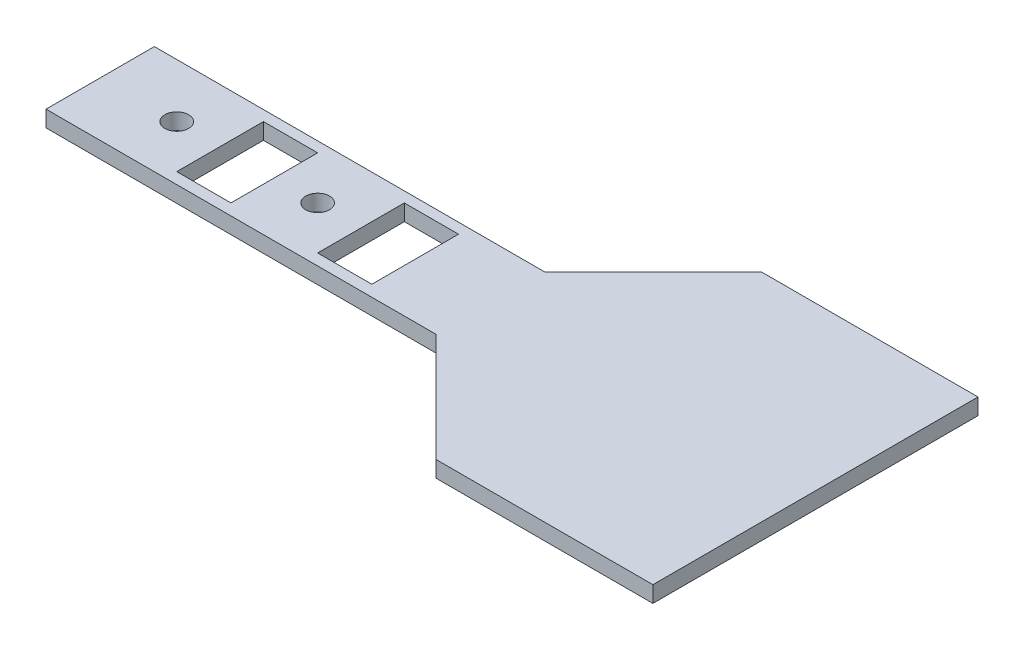
ISO-10303-21;
HEADER;
FILE_DESCRIPTION(('STEP AP214'),'2;1');
FILE_NAME('part.step','',(''),(''),'','','');
FILE_SCHEMA(('AUTOMOTIVE_DESIGN { 1 0 10303 214 1 1 1 1 }'));
ENDSEC;
DATA;
#1=APPLICATION_CONTEXT('core data for automotive mechanical design processes');
#2=APPLICATION_PROTOCOL_DEFINITION('international standard','automotive_design',2000,#1);
#3=PRODUCT_CONTEXT('',#1,'mechanical');
#4=PRODUCT('Part','Part','',(#3));
#5=PRODUCT_RELATED_PRODUCT_CATEGORY('part','',(#4));
#6=PRODUCT_DEFINITION_FORMATION('','',#4);
#7=PRODUCT_DEFINITION_CONTEXT('part definition',#1,'design');
#8=PRODUCT_DEFINITION('design','',#6,#7);
#9=PRODUCT_DEFINITION_SHAPE('','',#8);
#10=(LENGTH_UNIT() NAMED_UNIT(*) SI_UNIT(.MILLI.,.METRE.));
#11=(NAMED_UNIT(*) PLANE_ANGLE_UNIT() SI_UNIT($,.RADIAN.));
#12=(NAMED_UNIT(*) SI_UNIT($,.STERADIAN.) SOLID_ANGLE_UNIT());
#13=UNCERTAINTY_MEASURE_WITH_UNIT(LENGTH_MEASURE(1.E-05),#10,'distance_accuracy_value','');
#14=(GEOMETRIC_REPRESENTATION_CONTEXT(3) GLOBAL_UNCERTAINTY_ASSIGNED_CONTEXT((#13)) GLOBAL_UNIT_ASSIGNED_CONTEXT((#10,
#11,#12)) REPRESENTATION_CONTEXT('',''));
#15=CARTESIAN_POINT('',(0.,0.,0.));
#16=DIRECTION('',(0.,0.,1.));
#17=DIRECTION('',(1.,0.,0.));
#18=AXIS2_PLACEMENT_3D('',#15,#16,#17);
#19=CARTESIAN_POINT('',(59.2531040564104,19.1455775802872,44.0517027297108));
#20=DIRECTION('',(0.,0.,-1.));
#21=DIRECTION('',(-1.,0.,0.));
#22=AXIS2_PLACEMENT_3D('',#19,#20,#21);
#23=PLANE('',#22);
#24=DIRECTION('',(1.,0.,0.));
#25=VECTOR('',#24,1.);
#26=CARTESIAN_POINT('',(59.2531040564104,17.6455775802872,44.0517027297108));
#27=LINE('',#26,#25);
#28=CARTESIAN_POINT('',(39.2531040564103,17.6455775802872,44.0517027297108));
#29=VERTEX_POINT('',#28);
#30=CARTESIAN_POINT('',(59.2531040564104,17.6455775802872,44.0517027297108));
#31=VERTEX_POINT('',#30);
#32=EDGE_CURVE('E64',#29,#31,#27,.T.);
#33=ORIENTED_EDGE('',*,*,#32,.T.);
#34=DIRECTION('',(0.,-1.,0.));
#35=VECTOR('',#34,1.);
#36=CARTESIAN_POINT('',(59.2531040564104,19.1455775802872,44.0517027297108));
#37=LINE('',#36,#35);
#38=CARTESIAN_POINT('',(59.2531040564104,19.1455775802872,44.0517027297108));
#39=VERTEX_POINT('',#38);
#40=EDGE_CURVE('E11',#39,#31,#37,.T.);
#41=ORIENTED_EDGE('',*,*,#40,.F.);
#42=DIRECTION('',(1.,0.,0.));
#43=VECTOR('',#42,1.);
#44=CARTESIAN_POINT('',(59.2531040564104,19.1455775802872,44.0517027297108));
#45=LINE('',#44,#43);
#46=CARTESIAN_POINT('',(39.2531040564103,19.1455775802872,44.0517027297108));
#47=VERTEX_POINT('',#46);
#48=EDGE_CURVE('E75',#47,#39,#45,.T.);
#49=ORIENTED_EDGE('',*,*,#48,.F.);
#50=DIRECTION('',(0.,-1.,0.));
#51=VECTOR('',#50,1.);
#52=CARTESIAN_POINT('',(39.2531040564103,19.1455775802872,44.0517027297108));
#53=LINE('',#52,#51);
#54=EDGE_CURVE('E264',#47,#29,#53,.T.);
#55=ORIENTED_EDGE('',*,*,#54,.T.);
#56=EDGE_LOOP('',(#33,#41,#49,#55));
#57=FACE_BOUND('',#56,.T.);
#58=ADVANCED_FACE('F34',(#57),#23,.F.);
#59=CARTESIAN_POINT('',(59.2531040564104,19.1455775802872,44.0517027297108));
#60=DIRECTION('',(-1.,0.,0.));
#61=DIRECTION('',(0.,0.,1.));
#62=AXIS2_PLACEMENT_3D('',#59,#60,#61);
#63=PLANE('',#62);
#64=DIRECTION('',(0.,0.,-1.));
#65=VECTOR('',#64,1.);
#66=CARTESIAN_POINT('',(59.2531040564104,17.6455775802872,44.0517027297108));
#67=LINE('',#66,#65);
#68=CARTESIAN_POINT('',(59.2531040564104,17.6455775802872,14.0517027297108));
#69=VERTEX_POINT('',#68);
#70=EDGE_CURVE('E70',#31,#69,#67,.T.);
#71=ORIENTED_EDGE('',*,*,#70,.T.);
#72=DIRECTION('',(0.,-1.,0.));
#73=VECTOR('',#72,1.);
#74=CARTESIAN_POINT('',(59.2531040564104,19.1455775802872,14.0517027297108));
#75=LINE('',#74,#73);
#76=CARTESIAN_POINT('',(59.2531040564104,19.1455775802872,14.0517027297108));
#77=VERTEX_POINT('',#76);
#78=EDGE_CURVE('E42',#77,#69,#75,.T.);
#79=ORIENTED_EDGE('',*,*,#78,.F.);
#80=DIRECTION('',(0.,0.,-1.));
#81=VECTOR('',#80,1.);
#82=CARTESIAN_POINT('',(59.2531040564104,19.1455775802872,44.0517027297108));
#83=LINE('',#82,#81);
#84=EDGE_CURVE('E278',#39,#77,#83,.T.);
#85=ORIENTED_EDGE('',*,*,#84,.F.);
#86=ORIENTED_EDGE('',*,*,#40,.T.);
#87=EDGE_LOOP('',(#71,#79,#85,#86));
#88=FACE_BOUND('',#87,.T.);
#89=ADVANCED_FACE('F317',(#88),#63,.F.);
#90=CARTESIAN_POINT('',(59.2531040564104,19.1455775802872,14.0517027297108));
#91=DIRECTION('',(0.,0.,1.));
#92=DIRECTION('',(1.,0.,0.));
#93=AXIS2_PLACEMENT_3D('',#90,#91,#92);
#94=PLANE('',#93);
#95=DIRECTION('',(-1.,0.,0.));
#96=VECTOR('',#95,1.);
#97=CARTESIAN_POINT('',(59.2531040564104,17.6455775802872,14.0517027297108));
#98=LINE('',#97,#96);
#99=CARTESIAN_POINT('',(39.2531040564103,17.6455775802872,14.0517027297108));
#100=VERTEX_POINT('',#99);
#101=EDGE_CURVE('E279',#69,#100,#98,.T.);
#102=ORIENTED_EDGE('',*,*,#101,.T.);
#103=DIRECTION('',(0.,-1.,0.));
#104=VECTOR('',#103,1.);
#105=CARTESIAN_POINT('',(39.2531040564103,19.1455775802872,14.0517027297108));
#106=LINE('',#105,#104);
#107=CARTESIAN_POINT('',(39.2531040564103,19.1455775802872,14.0517027297108));
#108=VERTEX_POINT('',#107);
#109=EDGE_CURVE('E274',#108,#100,#106,.T.);
#110=ORIENTED_EDGE('',*,*,#109,.F.);
#111=DIRECTION('',(-1.,0.,0.));
#112=VECTOR('',#111,1.);
#113=CARTESIAN_POINT('',(59.2531040564104,19.1455775802872,14.0517027297108));
#114=LINE('',#113,#112);
#115=EDGE_CURVE('E50',#77,#108,#114,.T.);
#116=ORIENTED_EDGE('',*,*,#115,.F.);
#117=ORIENTED_EDGE('',*,*,#78,.T.);
#118=EDGE_LOOP('',(#102,#110,#116,#117));
#119=FACE_BOUND('',#118,.T.);
#120=ADVANCED_FACE('F286',(#119),#94,.F.);
#121=CARTESIAN_POINT('',(49.2531040564104,19.1455775802872,29.0517027297108));
#122=DIRECTION('',(0.,1.,0.));
#123=DIRECTION('',(0.,0.,1.));
#124=AXIS2_PLACEMENT_3D('',#121,#122,#123);
#125=PLANE('',#124);
#126=ORIENTED_EDGE('',*,*,#115,.T.);
#127=DIRECTION('',(-0.707106781186548,0.,0.707106781186548));
#128=VECTOR('',#127,1.);
#129=CARTESIAN_POINT('',(29.2531040564103,19.1455775802872,24.0517027297108));
#130=LINE('',#129,#128);
#131=CARTESIAN_POINT('',(29.2531040564103,19.1455775802872,24.0517027297108));
#132=VERTEX_POINT('',#131);
#133=EDGE_CURVE('E259',#108,#132,#130,.T.);
#134=ORIENTED_EDGE('',*,*,#133,.T.);
#135=DIRECTION('',(-1.,0.,0.));
#136=VECTOR('',#135,1.);
#137=CARTESIAN_POINT('',(-6.74689594358964,19.1455775802872,24.0517027297108));
#138=LINE('',#137,#136);
#139=CARTESIAN_POINT('',(-6.74689594358964,19.1455775802872,24.0517027297108));
#140=VERTEX_POINT('',#139);
#141=EDGE_CURVE('E237',#132,#140,#138,.T.);
#142=ORIENTED_EDGE('',*,*,#141,.T.);
#143=DIRECTION('',(0.,0.,1.));
#144=VECTOR('',#143,1.);
#145=CARTESIAN_POINT('',(-6.74689594358964,19.1455775802872,24.0517027297108));
#146=LINE('',#145,#144);
#147=CARTESIAN_POINT('',(-6.74689594358965,19.1455775802872,34.0517027297108));
#148=VERTEX_POINT('',#147);
#149=EDGE_CURVE('E239',#140,#148,#146,.T.);
#150=ORIENTED_EDGE('',*,*,#149,.T.);
#151=DIRECTION('',(1.,0.,0.));
#152=VECTOR('',#151,1.);
#153=CARTESIAN_POINT('',(-6.74689594358965,19.1455775802872,34.0517027297108));
#154=LINE('',#153,#152);
#155=CARTESIAN_POINT('',(29.2531040564103,19.1455775802872,34.0517027297108));
#156=VERTEX_POINT('',#155);
#157=EDGE_CURVE('E242',#148,#156,#154,.T.);
#158=ORIENTED_EDGE('',*,*,#157,.T.);
#159=DIRECTION('',(0.707106781186548,0.,0.707106781186547));
#160=VECTOR('',#159,1.);
#161=CARTESIAN_POINT('',(29.2531040564103,19.1455775802872,34.0517027297108));
#162=LINE('',#161,#160);
#163=EDGE_CURVE('E261',#156,#47,#162,.T.);
#164=ORIENTED_EDGE('',*,*,#163,.T.);
#165=ORIENTED_EDGE('',*,*,#48,.T.);
#166=ORIENTED_EDGE('',*,*,#84,.T.);
#167=EDGE_LOOP('',(#126,#134,#142,#150,#158,#164,#165,#166));
#168=FACE_BOUND('',#167,.T.);
#169=CARTESIAN_POINT('',(0.278932123710249,19.1455775802872,29.0130174497108));
#170=DIRECTION('',(0.,1.,0.));
#171=DIRECTION('',(0.,0.,1.));
#172=AXIS2_PLACEMENT_3D('',#169,#170,#171);
#173=CIRCLE('',#172,1.1);
#174=CARTESIAN_POINT('',(0.278932123710249,19.1455775802872,30.1130174497108));
#175=VERTEX_POINT('',#174);
#176=EDGE_CURVE('E184',#175,#175,#173,.T.);
#177=ORIENTED_EDGE('',*,*,#176,.F.);
#178=EDGE_LOOP('',(#177));
#179=FACE_BOUND('',#178,.T.);
#180=DIRECTION('',(0.,0.,-1.));
#181=VECTOR('',#180,1.);
#182=CARTESIAN_POINT('',(9.27893212371025,19.1455775802872,25.0130174497108));
#183=LINE('',#182,#181);
#184=CARTESIAN_POINT('',(9.27893212371025,19.1455775802872,33.0130174497108));
#185=VERTEX_POINT('',#184);
#186=CARTESIAN_POINT('',(9.27893212371025,19.1455775802872,25.0130174497108));
#187=VERTEX_POINT('',#186);
#188=EDGE_CURVE('E160',#185,#187,#183,.T.);
#189=ORIENTED_EDGE('',*,*,#188,.F.);
#190=DIRECTION('',(1.,0.,0.));
#191=VECTOR('',#190,1.);
#192=CARTESIAN_POINT('',(4.27893212371025,19.1455775802872,33.0130174497108));
#193=LINE('',#192,#191);
#194=CARTESIAN_POINT('',(4.27893212371025,19.1455775802872,33.0130174497108));
#195=VERTEX_POINT('',#194);
#196=EDGE_CURVE('E178',#195,#185,#193,.T.);
#197=ORIENTED_EDGE('',*,*,#196,.F.);
#198=DIRECTION('',(0.,0.,1.));
#199=VECTOR('',#198,1.);
#200=CARTESIAN_POINT('',(4.27893212371025,19.1455775802872,25.0130174497108));
#201=LINE('',#200,#199);
#202=CARTESIAN_POINT('',(4.27893212371025,19.1455775802872,25.0130174497108));
#203=VERTEX_POINT('',#202);
#204=EDGE_CURVE('E181',#203,#195,#201,.T.);
#205=ORIENTED_EDGE('',*,*,#204,.F.);
#206=DIRECTION('',(-1.,0.,0.));
#207=VECTOR('',#206,1.);
#208=CARTESIAN_POINT('',(4.27893212371025,19.1455775802872,25.0130174497108));
#209=LINE('',#208,#207);
#210=EDGE_CURVE('E190',#187,#203,#209,.T.);
#211=ORIENTED_EDGE('',*,*,#210,.F.);
#212=EDGE_LOOP('',(#189,#197,#205,#211));
#213=FACE_BOUND('',#212,.T.);
#214=CARTESIAN_POINT('',(13.2789321237103,19.1455775802872,29.0130174497108));
#215=DIRECTION('',(0.,1.,0.));
#216=DIRECTION('',(0.,0.,1.));
#217=AXIS2_PLACEMENT_3D('',#214,#215,#216);
#218=CIRCLE('',#217,1.1);
#219=CARTESIAN_POINT('',(13.2789321237103,19.1455775802872,30.1130174497108));
#220=VERTEX_POINT('',#219);
#221=EDGE_CURVE('E202',#220,#220,#218,.T.);
#222=ORIENTED_EDGE('',*,*,#221,.F.);
#223=EDGE_LOOP('',(#222));
#224=FACE_BOUND('',#223,.T.);
#225=DIRECTION('',(0.,0.,-1.));
#226=VECTOR('',#225,1.);
#227=CARTESIAN_POINT('',(22.2794489764104,19.1455775802872,25.0130174497108));
#228=LINE('',#227,#226);
#229=CARTESIAN_POINT('',(22.2794489764104,19.1455775802872,33.0130174497108));
#230=VERTEX_POINT('',#229);
#231=CARTESIAN_POINT('',(22.2794489764104,19.1455775802872,25.0130174497108));
#232=VERTEX_POINT('',#231);
#233=EDGE_CURVE('E220',#230,#232,#228,.T.);
#234=ORIENTED_EDGE('',*,*,#233,.F.);
#235=DIRECTION('',(1.,0.,0.));
#236=VECTOR('',#235,1.);
#237=CARTESIAN_POINT('',(17.2794489764104,19.1455775802872,33.0130174497108));
#238=LINE('',#237,#236);
#239=CARTESIAN_POINT('',(17.2794489764104,19.1455775802872,33.0130174497108));
#240=VERTEX_POINT('',#239);
#241=EDGE_CURVE('E210',#240,#230,#238,.T.);
#242=ORIENTED_EDGE('',*,*,#241,.F.);
#243=DIRECTION('',(0.,0.,1.));
#244=VECTOR('',#243,1.);
#245=CARTESIAN_POINT('',(17.2794489764104,19.1455775802872,25.0130174497108));
#246=LINE('',#245,#244);
#247=CARTESIAN_POINT('',(17.2794489764104,19.1455775802872,25.0130174497108));
#248=VERTEX_POINT('',#247);
#249=EDGE_CURVE('E225',#248,#240,#246,.T.);
#250=ORIENTED_EDGE('',*,*,#249,.F.);
#251=DIRECTION('',(-1.,0.,0.));
#252=VECTOR('',#251,1.);
#253=CARTESIAN_POINT('',(17.2794489764104,19.1455775802872,25.0130174497108));
#254=LINE('',#253,#252);
#255=EDGE_CURVE('E222',#232,#248,#254,.T.);
#256=ORIENTED_EDGE('',*,*,#255,.F.);
#257=EDGE_LOOP('',(#234,#242,#250,#256));
#258=FACE_BOUND('',#257,.T.);
#259=ADVANCED_FACE('F298',(#168,#179,#213,#224,#258),#125,.T.);
#260=CARTESIAN_POINT('',(49.2531040564104,17.6455775802872,29.0517027297108));
#261=DIRECTION('',(0.,1.,0.));
#262=DIRECTION('',(0.,0.,1.));
#263=AXIS2_PLACEMENT_3D('',#260,#261,#262);
#264=PLANE('',#263);
#265=ORIENTED_EDGE('',*,*,#32,.F.);
#266=DIRECTION('',(0.707106781186548,0.,0.707106781186547));
#267=VECTOR('',#266,1.);
#268=CARTESIAN_POINT('',(29.2531040564103,17.6455775802872,34.0517027297108));
#269=LINE('',#268,#267);
#270=CARTESIAN_POINT('',(29.2531040564103,17.6455775802872,34.0517027297108));
#271=VERTEX_POINT('',#270);
#272=EDGE_CURVE('E262',#271,#29,#269,.T.);
#273=ORIENTED_EDGE('',*,*,#272,.F.);
#274=DIRECTION('',(1.,0.,0.));
#275=VECTOR('',#274,1.);
#276=CARTESIAN_POINT('',(-6.74689594358965,17.6455775802872,34.0517027297108));
#277=LINE('',#276,#275);
#278=CARTESIAN_POINT('',(-6.74689594358965,17.6455775802872,34.0517027297108));
#279=VERTEX_POINT('',#278);
#280=EDGE_CURVE('E240',#279,#271,#277,.T.);
#281=ORIENTED_EDGE('',*,*,#280,.F.);
#282=DIRECTION('',(0.,0.,1.));
#283=VECTOR('',#282,1.);
#284=CARTESIAN_POINT('',(-6.74689594358964,17.6455775802872,24.0517027297108));
#285=LINE('',#284,#283);
#286=CARTESIAN_POINT('',(-6.74689594358964,17.6455775802872,24.0517027297108));
#287=VERTEX_POINT('',#286);
#288=EDGE_CURVE('E248',#287,#279,#285,.T.);
#289=ORIENTED_EDGE('',*,*,#288,.F.);
#290=DIRECTION('',(-1.,0.,0.));
#291=VECTOR('',#290,1.);
#292=CARTESIAN_POINT('',(-6.74689594358964,17.6455775802872,24.0517027297108));
#293=LINE('',#292,#291);
#294=CARTESIAN_POINT('',(29.2531040564103,17.6455775802872,24.0517027297108));
#295=VERTEX_POINT('',#294);
#296=EDGE_CURVE('E246',#295,#287,#293,.T.);
#297=ORIENTED_EDGE('',*,*,#296,.F.);
#298=DIRECTION('',(-0.707106781186548,0.,0.707106781186548));
#299=VECTOR('',#298,1.);
#300=CARTESIAN_POINT('',(29.2531040564103,17.6455775802872,24.0517027297108));
#301=LINE('',#300,#299);
#302=EDGE_CURVE('E258',#100,#295,#301,.T.);
#303=ORIENTED_EDGE('',*,*,#302,.F.);
#304=ORIENTED_EDGE('',*,*,#101,.F.);
#305=ORIENTED_EDGE('',*,*,#70,.F.);
#306=EDGE_LOOP('',(#265,#273,#281,#289,#297,#303,#304,#305));
#307=FACE_BOUND('',#306,.T.);
#308=CARTESIAN_POINT('',(0.278932123710249,17.6455775802872,29.0130174497108));
#309=DIRECTION('',(0.,1.,0.));
#310=DIRECTION('',(0.,0.,1.));
#311=AXIS2_PLACEMENT_3D('',#308,#309,#310);
#312=CIRCLE('',#311,1.1);
#313=CARTESIAN_POINT('',(0.278932123710249,17.6455775802872,30.1130174497108));
#314=VERTEX_POINT('',#313);
#315=EDGE_CURVE('E249',#314,#314,#312,.T.);
#316=ORIENTED_EDGE('',*,*,#315,.T.);
#317=EDGE_LOOP('',(#316));
#318=FACE_BOUND('',#317,.T.);
#319=DIRECTION('',(1.,0.,0.));
#320=VECTOR('',#319,1.);
#321=CARTESIAN_POINT('',(4.27893212371025,17.6455775802872,33.0130174497108));
#322=LINE('',#321,#320);
#323=CARTESIAN_POINT('',(4.27893212371025,17.6455775802872,33.0130174497108));
#324=VERTEX_POINT('',#323);
#325=CARTESIAN_POINT('',(9.27893212371025,17.6455775802872,33.0130174497108));
#326=VERTEX_POINT('',#325);
#327=EDGE_CURVE('E165',#324,#326,#322,.T.);
#328=ORIENTED_EDGE('',*,*,#327,.T.);
#329=DIRECTION('',(0.,0.,-1.));
#330=VECTOR('',#329,1.);
#331=CARTESIAN_POINT('',(9.27893212371025,17.6455775802872,25.0130174497108));
#332=LINE('',#331,#330);
#333=CARTESIAN_POINT('',(9.27893212371025,17.6455775802872,25.0130174497108));
#334=VERTEX_POINT('',#333);
#335=EDGE_CURVE('E157',#326,#334,#332,.T.);
#336=ORIENTED_EDGE('',*,*,#335,.T.);
#337=DIRECTION('',(-1.,0.,0.));
#338=VECTOR('',#337,1.);
#339=CARTESIAN_POINT('',(4.27893212371025,17.6455775802872,25.0130174497108));
#340=LINE('',#339,#338);
#341=CARTESIAN_POINT('',(4.27893212371025,17.6455775802872,25.0130174497108));
#342=VERTEX_POINT('',#341);
#343=EDGE_CURVE('E169',#334,#342,#340,.T.);
#344=ORIENTED_EDGE('',*,*,#343,.T.);
#345=DIRECTION('',(0.,0.,1.));
#346=VECTOR('',#345,1.);
#347=CARTESIAN_POINT('',(4.27893212371025,17.6455775802872,25.0130174497108));
#348=LINE('',#347,#346);
#349=EDGE_CURVE('E173',#342,#324,#348,.T.);
#350=ORIENTED_EDGE('',*,*,#349,.T.);
#351=EDGE_LOOP('',(#328,#336,#344,#350));
#352=FACE_BOUND('',#351,.T.);
#353=CARTESIAN_POINT('',(13.2789321237103,17.6455775802872,29.0130174497108));
#354=DIRECTION('',(0.,1.,0.));
#355=DIRECTION('',(0.,0.,1.));
#356=AXIS2_PLACEMENT_3D('',#353,#354,#355);
#357=CIRCLE('',#356,1.1);
#358=CARTESIAN_POINT('',(13.2789321237103,17.6455775802872,30.1130174497108));
#359=VERTEX_POINT('',#358);
#360=EDGE_CURVE('E191',#359,#359,#357,.T.);
#361=ORIENTED_EDGE('',*,*,#360,.T.);
#362=EDGE_LOOP('',(#361));
#363=FACE_BOUND('',#362,.T.);
#364=DIRECTION('',(1.,0.,0.));
#365=VECTOR('',#364,1.);
#366=CARTESIAN_POINT('',(17.2794489764104,17.6455775802872,33.0130174497108));
#367=LINE('',#366,#365);
#368=CARTESIAN_POINT('',(17.2794489764104,17.6455775802872,33.0130174497108));
#369=VERTEX_POINT('',#368);
#370=CARTESIAN_POINT('',(22.2794489764104,17.6455775802872,33.0130174497108));
#371=VERTEX_POINT('',#370);
#372=EDGE_CURVE('E216',#369,#371,#367,.T.);
#373=ORIENTED_EDGE('',*,*,#372,.T.);
#374=DIRECTION('',(0.,0.,-1.));
#375=VECTOR('',#374,1.);
#376=CARTESIAN_POINT('',(22.2794489764104,17.6455775802872,25.0130174497108));
#377=LINE('',#376,#375);
#378=CARTESIAN_POINT('',(22.2794489764104,17.6455775802872,25.0130174497108));
#379=VERTEX_POINT('',#378);
#380=EDGE_CURVE('E206',#371,#379,#377,.T.);
#381=ORIENTED_EDGE('',*,*,#380,.T.);
#382=DIRECTION('',(-1.,0.,0.));
#383=VECTOR('',#382,1.);
#384=CARTESIAN_POINT('',(17.2794489764104,17.6455775802872,25.0130174497108));
#385=LINE('',#384,#383);
#386=CARTESIAN_POINT('',(17.2794489764104,17.6455775802872,25.0130174497108));
#387=VERTEX_POINT('',#386);
#388=EDGE_CURVE('E209',#379,#387,#385,.T.);
#389=ORIENTED_EDGE('',*,*,#388,.T.);
#390=DIRECTION('',(0.,0.,1.));
#391=VECTOR('',#390,1.);
#392=CARTESIAN_POINT('',(17.2794489764104,17.6455775802872,25.0130174497108));
#393=LINE('',#392,#391);
#394=EDGE_CURVE('E213',#387,#369,#393,.T.);
#395=ORIENTED_EDGE('',*,*,#394,.T.);
#396=EDGE_LOOP('',(#373,#381,#389,#395));
#397=FACE_BOUND('',#396,.T.);
#398=ADVANCED_FACE('F175',(#307,#318,#352,#363,#397),#264,.F.);
#399=CARTESIAN_POINT('',(29.2531040564103,19.1455775802872,24.0517027297108));
#400=DIRECTION('',(0.707106781186547,0.,0.707106781186547));
#401=DIRECTION('',(0.707106781186548,0.,-0.707106781186548));
#402=AXIS2_PLACEMENT_3D('',#399,#400,#401);
#403=PLANE('',#402);
#404=ORIENTED_EDGE('',*,*,#302,.T.);
#405=DIRECTION('',(0.,-1.,0.));
#406=VECTOR('',#405,1.);
#407=CARTESIAN_POINT('',(29.2531040564103,19.1455775802872,24.0517027297108));
#408=LINE('',#407,#406);
#409=EDGE_CURVE('E271',#132,#295,#408,.T.);
#410=ORIENTED_EDGE('',*,*,#409,.F.);
#411=ORIENTED_EDGE('',*,*,#133,.F.);
#412=ORIENTED_EDGE('',*,*,#109,.T.);
#413=EDGE_LOOP('',(#404,#410,#411,#412));
#414=FACE_BOUND('',#413,.T.);
#415=ADVANCED_FACE('F295',(#414),#403,.F.);
#416=CARTESIAN_POINT('',(29.2531040564103,19.1455775802872,34.0517027297108));
#417=DIRECTION('',(0.707106781186547,0.,-0.707106781186548));
#418=DIRECTION('',(-0.707106781186548,0.,-0.707106781186547));
#419=AXIS2_PLACEMENT_3D('',#416,#417,#418);
#420=PLANE('',#419);
#421=ORIENTED_EDGE('',*,*,#272,.T.);
#422=ORIENTED_EDGE('',*,*,#54,.F.);
#423=ORIENTED_EDGE('',*,*,#163,.F.);
#424=DIRECTION('',(0.,-1.,0.));
#425=VECTOR('',#424,1.);
#426=CARTESIAN_POINT('',(29.2531040564103,19.1455775802872,34.0517027297108));
#427=LINE('',#426,#425);
#428=EDGE_CURVE('E269',#156,#271,#427,.T.);
#429=ORIENTED_EDGE('',*,*,#428,.T.);
#430=EDGE_LOOP('',(#421,#422,#423,#429));
#431=FACE_BOUND('',#430,.T.);
#432=ADVANCED_FACE('F314',(#431),#420,.F.);
#433=CARTESIAN_POINT('',(-6.74689594358964,19.1455775802872,24.0517027297108));
#434=DIRECTION('',(0.,0.,1.));
#435=DIRECTION('',(1.,0.,0.));
#436=AXIS2_PLACEMENT_3D('',#433,#434,#435);
#437=PLANE('',#436);
#438=ORIENTED_EDGE('',*,*,#296,.T.);
#439=DIRECTION('',(0.,-1.,0.));
#440=VECTOR('',#439,1.);
#441=CARTESIAN_POINT('',(-6.74689594358964,19.1455775802872,24.0517027297108));
#442=LINE('',#441,#440);
#443=EDGE_CURVE('E255',#140,#287,#442,.T.);
#444=ORIENTED_EDGE('',*,*,#443,.F.);
#445=ORIENTED_EDGE('',*,*,#141,.F.);
#446=ORIENTED_EDGE('',*,*,#409,.T.);
#447=EDGE_LOOP('',(#438,#444,#445,#446));
#448=FACE_BOUND('',#447,.T.);
#449=ADVANCED_FACE('F304',(#448),#437,.F.);
#450=CARTESIAN_POINT('',(-6.74689594358964,19.1455775802872,24.0517027297108));
#451=DIRECTION('',(1.,0.,0.));
#452=DIRECTION('',(0.,0.,-1.));
#453=AXIS2_PLACEMENT_3D('',#450,#451,#452);
#454=PLANE('',#453);
#455=ORIENTED_EDGE('',*,*,#288,.T.);
#456=DIRECTION('',(0.,-1.,0.));
#457=VECTOR('',#456,1.);
#458=CARTESIAN_POINT('',(-6.74689594358965,19.1455775802872,34.0517027297108));
#459=LINE('',#458,#457);
#460=EDGE_CURVE('E245',#148,#279,#459,.T.);
#461=ORIENTED_EDGE('',*,*,#460,.F.);
#462=ORIENTED_EDGE('',*,*,#149,.F.);
#463=ORIENTED_EDGE('',*,*,#443,.T.);
#464=EDGE_LOOP('',(#455,#461,#462,#463));
#465=FACE_BOUND('',#464,.T.);
#466=ADVANCED_FACE('F306',(#465),#454,.F.);
#467=CARTESIAN_POINT('',(-6.74689594358965,19.1455775802872,34.0517027297108));
#468=DIRECTION('',(0.,0.,-1.));
#469=DIRECTION('',(-1.,0.,0.));
#470=AXIS2_PLACEMENT_3D('',#467,#468,#469);
#471=PLANE('',#470);
#472=ORIENTED_EDGE('',*,*,#280,.T.);
#473=ORIENTED_EDGE('',*,*,#428,.F.);
#474=ORIENTED_EDGE('',*,*,#157,.F.);
#475=ORIENTED_EDGE('',*,*,#460,.T.);
#476=EDGE_LOOP('',(#472,#473,#474,#475));
#477=FACE_BOUND('',#476,.T.);
#478=ADVANCED_FACE('F311',(#477),#471,.F.);
#479=CARTESIAN_POINT('',(22.2794489764104,17.6455775802872,25.0130174497108));
#480=DIRECTION('',(1.,0.,0.));
#481=DIRECTION('',(0.,0.,-1.));
#482=AXIS2_PLACEMENT_3D('',#479,#480,#481);
#483=PLANE('',#482);
#484=ORIENTED_EDGE('',*,*,#233,.T.);
#485=DIRECTION('',(0.,1.,0.));
#486=VECTOR('',#485,1.);
#487=CARTESIAN_POINT('',(22.2794489764104,17.6455775802872,25.0130174497108));
#488=LINE('',#487,#486);
#489=EDGE_CURVE('E219',#379,#232,#488,.T.);
#490=ORIENTED_EDGE('',*,*,#489,.F.);
#491=ORIENTED_EDGE('',*,*,#380,.F.);
#492=DIRECTION('',(0.,1.,0.));
#493=VECTOR('',#492,1.);
#494=CARTESIAN_POINT('',(22.2794489764104,17.6455775802872,33.0130174497108));
#495=LINE('',#494,#493);
#496=EDGE_CURVE('E205',#371,#230,#495,.T.);
#497=ORIENTED_EDGE('',*,*,#496,.T.);
#498=EDGE_LOOP('',(#484,#490,#491,#497));
#499=FACE_BOUND('',#498,.T.);
#500=ADVANCED_FACE('F339',(#499),#483,.F.);
#501=CARTESIAN_POINT('',(17.2794489764104,17.6455775802872,33.0130174497108));
#502=DIRECTION('',(0.,0.,1.));
#503=DIRECTION('',(1.,0.,0.));
#504=AXIS2_PLACEMENT_3D('',#501,#502,#503);
#505=PLANE('',#504);
#506=ORIENTED_EDGE('',*,*,#241,.T.);
#507=ORIENTED_EDGE('',*,*,#496,.F.);
#508=ORIENTED_EDGE('',*,*,#372,.F.);
#509=DIRECTION('',(0.,1.,0.));
#510=VECTOR('',#509,1.);
#511=CARTESIAN_POINT('',(17.2794489764104,17.6455775802872,33.0130174497108));
#512=LINE('',#511,#510);
#513=EDGE_CURVE('E231',#369,#240,#512,.T.);
#514=ORIENTED_EDGE('',*,*,#513,.T.);
#515=EDGE_LOOP('',(#506,#507,#508,#514));
#516=FACE_BOUND('',#515,.T.);
#517=ADVANCED_FACE('F342',(#516),#505,.F.);
#518=CARTESIAN_POINT('',(17.2794489764104,17.6455775802872,25.0130174497108));
#519=DIRECTION('',(-1.,0.,0.));
#520=DIRECTION('',(0.,0.,1.));
#521=AXIS2_PLACEMENT_3D('',#518,#519,#520);
#522=PLANE('',#521);
#523=ORIENTED_EDGE('',*,*,#249,.T.);
#524=ORIENTED_EDGE('',*,*,#513,.F.);
#525=ORIENTED_EDGE('',*,*,#394,.F.);
#526=DIRECTION('',(0.,1.,0.));
#527=VECTOR('',#526,1.);
#528=CARTESIAN_POINT('',(17.2794489764104,17.6455775802872,25.0130174497108));
#529=LINE('',#528,#527);
#530=EDGE_CURVE('E233',#387,#248,#529,.T.);
#531=ORIENTED_EDGE('',*,*,#530,.T.);
#532=EDGE_LOOP('',(#523,#524,#525,#531));
#533=FACE_BOUND('',#532,.T.);
#534=ADVANCED_FACE('F348',(#533),#522,.F.);
#535=CARTESIAN_POINT('',(17.2794489764104,17.6455775802872,25.0130174497108));
#536=DIRECTION('',(0.,0.,-1.));
#537=DIRECTION('',(-1.,0.,0.));
#538=AXIS2_PLACEMENT_3D('',#535,#536,#537);
#539=PLANE('',#538);
#540=ORIENTED_EDGE('',*,*,#255,.T.);
#541=ORIENTED_EDGE('',*,*,#530,.F.);
#542=ORIENTED_EDGE('',*,*,#388,.F.);
#543=ORIENTED_EDGE('',*,*,#489,.T.);
#544=EDGE_LOOP('',(#540,#541,#542,#543));
#545=FACE_BOUND('',#544,.T.);
#546=ADVANCED_FACE('F344',(#545),#539,.F.);
#547=CARTESIAN_POINT('',(13.2789321237103,17.6455775802872,29.0130174497108));
#548=DIRECTION('',(0.,1.,0.));
#549=DIRECTION('',(0.,0.,1.));
#550=AXIS2_PLACEMENT_3D('',#547,#548,#549);
#551=CYLINDRICAL_SURFACE('',#550,1.1);
#552=ORIENTED_EDGE('',*,*,#360,.F.);
#553=EDGE_LOOP('',(#552));
#554=FACE_BOUND('',#553,.T.);
#555=ORIENTED_EDGE('',*,*,#221,.T.);
#556=EDGE_LOOP('',(#555));
#557=FACE_BOUND('',#556,.T.);
#558=ADVANCED_FACE('F347',(#554,#557),#551,.F.);
#559=CARTESIAN_POINT('',(9.27893212371025,17.6455775802872,25.0130174497108));
#560=DIRECTION('',(1.,0.,0.));
#561=DIRECTION('',(0.,0.,-1.));
#562=AXIS2_PLACEMENT_3D('',#559,#560,#561);
#563=PLANE('',#562);
#564=ORIENTED_EDGE('',*,*,#188,.T.);
#565=DIRECTION('',(0.,1.,0.));
#566=VECTOR('',#565,1.);
#567=CARTESIAN_POINT('',(9.27893212371025,17.6455775802872,25.0130174497108));
#568=LINE('',#567,#566);
#569=EDGE_CURVE('E153',#334,#187,#568,.T.);
#570=ORIENTED_EDGE('',*,*,#569,.F.);
#571=ORIENTED_EDGE('',*,*,#335,.F.);
#572=DIRECTION('',(0.,1.,0.));
#573=VECTOR('',#572,1.);
#574=CARTESIAN_POINT('',(9.27893212371025,17.6455775802872,33.0130174497108));
#575=LINE('',#574,#573);
#576=EDGE_CURVE('E195',#326,#185,#575,.T.);
#577=ORIENTED_EDGE('',*,*,#576,.T.);
#578=EDGE_LOOP('',(#564,#570,#571,#577));
#579=FACE_BOUND('',#578,.T.);
#580=ADVANCED_FACE('F155',(#579),#563,.F.);
#581=CARTESIAN_POINT('',(4.27893212371025,17.6455775802872,33.0130174497108));
#582=DIRECTION('',(0.,0.,1.));
#583=DIRECTION('',(1.,0.,0.));
#584=AXIS2_PLACEMENT_3D('',#581,#582,#583);
#585=PLANE('',#584);
#586=ORIENTED_EDGE('',*,*,#196,.T.);
#587=ORIENTED_EDGE('',*,*,#576,.F.);
#588=ORIENTED_EDGE('',*,*,#327,.F.);
#589=DIRECTION('',(0.,1.,0.));
#590=VECTOR('',#589,1.);
#591=CARTESIAN_POINT('',(4.27893212371025,17.6455775802872,33.0130174497108));
#592=LINE('',#591,#590);
#593=EDGE_CURVE('E197',#324,#195,#592,.T.);
#594=ORIENTED_EDGE('',*,*,#593,.T.);
#595=EDGE_LOOP('',(#586,#587,#588,#594));
#596=FACE_BOUND('',#595,.T.);
#597=ADVANCED_FACE('F361',(#596),#585,.F.);
#598=CARTESIAN_POINT('',(4.27893212371025,17.6455775802872,25.0130174497108));
#599=DIRECTION('',(-1.,0.,0.));
#600=DIRECTION('',(0.,0.,1.));
#601=AXIS2_PLACEMENT_3D('',#598,#599,#600);
#602=PLANE('',#601);
#603=ORIENTED_EDGE('',*,*,#204,.T.);
#604=ORIENTED_EDGE('',*,*,#593,.F.);
#605=ORIENTED_EDGE('',*,*,#349,.F.);
#606=DIRECTION('',(0.,1.,0.));
#607=VECTOR('',#606,1.);
#608=CARTESIAN_POINT('',(4.27893212371025,17.6455775802872,25.0130174497108));
#609=LINE('',#608,#607);
#610=EDGE_CURVE('E164',#342,#203,#609,.T.);
#611=ORIENTED_EDGE('',*,*,#610,.T.);
#612=EDGE_LOOP('',(#603,#604,#605,#611));
#613=FACE_BOUND('',#612,.T.);
#614=ADVANCED_FACE('F365',(#613),#602,.F.);
#615=CARTESIAN_POINT('',(4.27893212371025,17.6455775802872,25.0130174497108));
#616=DIRECTION('',(0.,0.,-1.));
#617=DIRECTION('',(-1.,0.,0.));
#618=AXIS2_PLACEMENT_3D('',#615,#616,#617);
#619=PLANE('',#618);
#620=ORIENTED_EDGE('',*,*,#210,.T.);
#621=ORIENTED_EDGE('',*,*,#610,.F.);
#622=ORIENTED_EDGE('',*,*,#343,.F.);
#623=ORIENTED_EDGE('',*,*,#569,.T.);
#624=EDGE_LOOP('',(#620,#621,#622,#623));
#625=FACE_BOUND('',#624,.T.);
#626=ADVANCED_FACE('F170',(#625),#619,.F.);
#627=CARTESIAN_POINT('',(0.278932123710249,17.6455775802872,29.0130174497108));
#628=DIRECTION('',(0.,1.,0.));
#629=DIRECTION('',(0.,0.,1.));
#630=AXIS2_PLACEMENT_3D('',#627,#628,#629);
#631=CYLINDRICAL_SURFACE('',#630,1.1);
#632=ORIENTED_EDGE('',*,*,#315,.F.);
#633=EDGE_LOOP('',(#632));
#634=FACE_BOUND('',#633,.T.);
#635=ORIENTED_EDGE('',*,*,#176,.T.);
#636=EDGE_LOOP('',(#635));
#637=FACE_BOUND('',#636,.T.);
#638=ADVANCED_FACE('F364',(#634,#637),#631,.F.);
#639=CLOSED_SHELL('',(#58,#89,#120,#259,#398,#415,#432,#449,#466,#478,#500,#517,#534,#546,#558,
#580,#597,#614,#626,#638));
#640=MANIFOLD_SOLID_BREP('B2',#639);
#641=ADVANCED_BREP_SHAPE_REPRESENTATION('',(#18,#640),#14);
#642=SHAPE_DEFINITION_REPRESENTATION(#9,#641);
ENDSEC;
END-ISO-10303-21;
